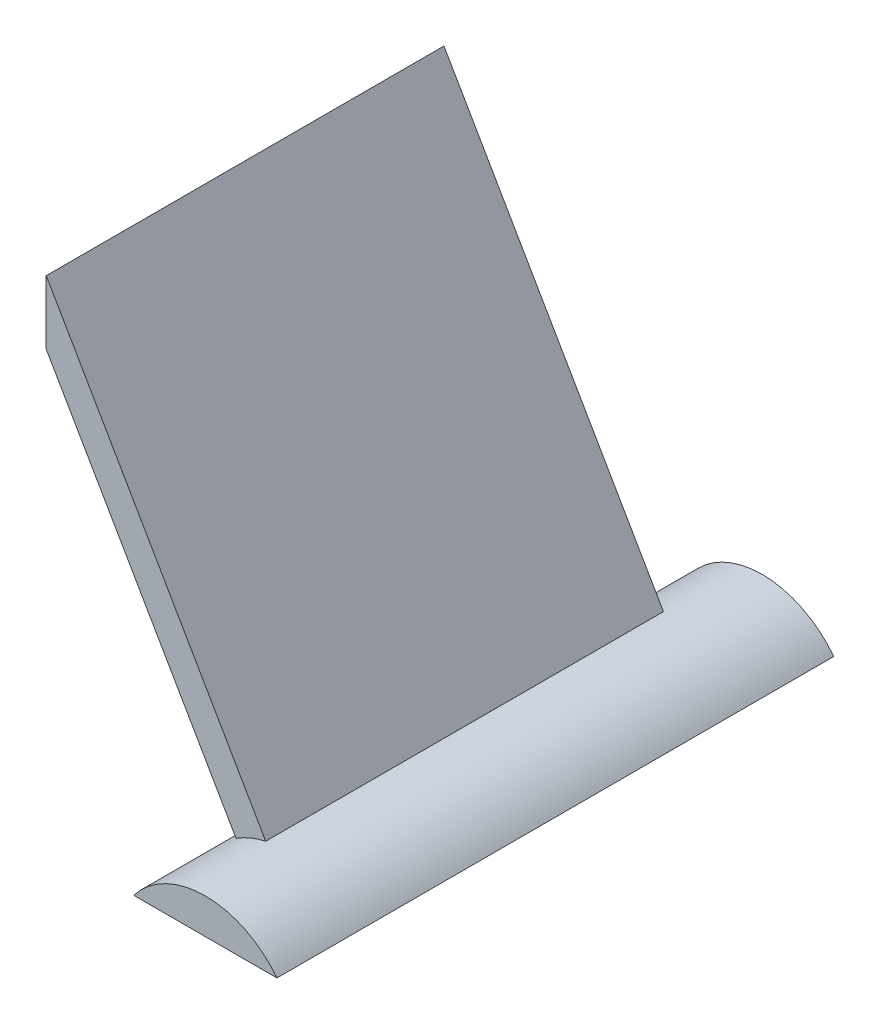
ISO-10303-21;
HEADER;
FILE_DESCRIPTION(('STEP AP214'),'2;1');
FILE_NAME('part.step','',(''),(''),'','','');
FILE_SCHEMA(('AUTOMOTIVE_DESIGN { 1 0 10303 214 1 1 1 1 }'));
ENDSEC;
DATA;
#1=APPLICATION_CONTEXT('core data for automotive mechanical design processes');
#2=APPLICATION_PROTOCOL_DEFINITION('international standard','automotive_design',2000,#1);
#3=PRODUCT_CONTEXT('',#1,'mechanical');
#4=PRODUCT('Part','Part','',(#3));
#5=PRODUCT_RELATED_PRODUCT_CATEGORY('part','',(#4));
#6=PRODUCT_DEFINITION_FORMATION('','',#4);
#7=PRODUCT_DEFINITION_CONTEXT('part definition',#1,'design');
#8=PRODUCT_DEFINITION('design','',#6,#7);
#9=PRODUCT_DEFINITION_SHAPE('','',#8);
#10=(LENGTH_UNIT() NAMED_UNIT(*) SI_UNIT(.MILLI.,.METRE.));
#11=(NAMED_UNIT(*) PLANE_ANGLE_UNIT() SI_UNIT($,.RADIAN.));
#12=(NAMED_UNIT(*) SI_UNIT($,.STERADIAN.) SOLID_ANGLE_UNIT());
#13=UNCERTAINTY_MEASURE_WITH_UNIT(LENGTH_MEASURE(1.E-05),#10,'distance_accuracy_value','');
#14=(GEOMETRIC_REPRESENTATION_CONTEXT(3) GLOBAL_UNCERTAINTY_ASSIGNED_CONTEXT((#13)) GLOBAL_UNIT_ASSIGNED_CONTEXT((#10,
#11,#12)) REPRESENTATION_CONTEXT('',''));
#15=CARTESIAN_POINT('',(0.,0.,0.));
#16=DIRECTION('',(0.,0.,1.));
#17=DIRECTION('',(1.,0.,0.));
#18=AXIS2_PLACEMENT_3D('',#15,#16,#17);
#19=CARTESIAN_POINT('',(90.17,0.,-88.9));
#20=DIRECTION('',(0.,-1.,0.));
#21=DIRECTION('',(0.,0.,-1.));
#22=AXIS2_PLACEMENT_3D('',#19,#20,#21);
#23=PLANE('',#22);
#24=DIRECTION('',(1.,0.,0.));
#25=VECTOR('',#24,1.);
#26=CARTESIAN_POINT('',(90.17,0.,0.));
#27=LINE('',#26,#25);
#28=CARTESIAN_POINT('',(67.31,0.,0.));
#29=VERTEX_POINT('',#28);
#30=CARTESIAN_POINT('',(90.17,0.,0.));
#31=VERTEX_POINT('',#30);
#32=EDGE_CURVE('E73',#29,#31,#27,.T.);
#33=ORIENTED_EDGE('',*,*,#32,.F.);
#34=DIRECTION('',(0.,0.,1.));
#35=VECTOR('',#34,1.);
#36=CARTESIAN_POINT('',(67.31,0.,-88.9));
#37=LINE('',#36,#35);
#38=CARTESIAN_POINT('',(67.31,0.,-88.9));
#39=VERTEX_POINT('',#38);
#40=EDGE_CURVE('E69',#39,#29,#37,.T.);
#41=ORIENTED_EDGE('',*,*,#40,.F.);
#42=DIRECTION('',(1.,0.,0.));
#43=VECTOR('',#42,1.);
#44=CARTESIAN_POINT('',(90.17,0.,-88.9));
#45=LINE('',#44,#43);
#46=CARTESIAN_POINT('',(90.17,0.,-88.9));
#47=VERTEX_POINT('',#46);
#48=EDGE_CURVE('E79',#39,#47,#45,.T.);
#49=ORIENTED_EDGE('',*,*,#48,.T.);
#50=DIRECTION('',(0.,0.,1.));
#51=VECTOR('',#50,1.);
#52=CARTESIAN_POINT('',(90.17,0.,-88.9));
#53=LINE('',#52,#51);
#54=EDGE_CURVE('E57',#47,#31,#53,.T.);
#55=ORIENTED_EDGE('',*,*,#54,.T.);
#56=EDGE_LOOP('',(#33,#41,#49,#55));
#57=FACE_BOUND('',#56,.T.);
#58=ADVANCED_FACE('F33',(#57),#23,.T.);
#59=CARTESIAN_POINT('',(78.74,-8.76505945945948,-88.9));
#60=DIRECTION('',(0.,0.,1.));
#61=DIRECTION('',(1.,0.,0.));
#62=AXIS2_PLACEMENT_3D('',#59,#60,#61);
#63=CYLINDRICAL_SURFACE('',#62,14.4038594594595);
#64=CARTESIAN_POINT('',(78.74,-8.76505945945948,-76.2));
#65=DIRECTION('',(0.,0.,-1.));
#66=DIRECTION('',(-1.,0.,0.));
#67=AXIS2_PLACEMENT_3D('',#64,#65,#66);
#68=CIRCLE('',#67,14.4038594594595);
#69=CARTESIAN_POINT('',(75.6749046811141,5.30890082235188,-76.2));
#70=VERTEX_POINT('',#69);
#71=CARTESIAN_POINT('',(70.942491559073,3.34568079213262,-76.2));
#72=VERTEX_POINT('',#71);
#73=EDGE_CURVE('E11',#70,#72,#68,.F.);
#74=ORIENTED_EDGE('',*,*,#73,.F.);
#75=DIRECTION('',(0.,0.,1.));
#76=VECTOR('',#75,1.);
#77=CARTESIAN_POINT('',(75.6749046811141,5.30890082235188,-76.2));
#78=LINE('',#77,#76);
#79=CARTESIAN_POINT('',(75.6749046811141,5.30890082235188,-12.7));
#80=VERTEX_POINT('',#79);
#81=EDGE_CURVE('E96',#70,#80,#78,.T.);
#82=ORIENTED_EDGE('',*,*,#81,.T.);
#83=CARTESIAN_POINT('',(78.74,-8.76505945945948,-12.7));
#84=DIRECTION('',(0.,0.,-1.));
#85=DIRECTION('',(-1.,0.,0.));
#86=AXIS2_PLACEMENT_3D('',#83,#84,#85);
#87=CIRCLE('',#86,14.4038594594595);
#88=CARTESIAN_POINT('',(70.9424915590731,3.34568079213265,-12.7));
#89=VERTEX_POINT('',#88);
#90=EDGE_CURVE('E41',#80,#89,#87,.F.);
#91=ORIENTED_EDGE('',*,*,#90,.T.);
#92=DIRECTION('',(0.,0.,1.));
#93=VECTOR('',#92,1.);
#94=CARTESIAN_POINT('',(70.942491559073,3.34568079213262,-76.2));
#95=LINE('',#94,#93);
#96=EDGE_CURVE('E93',#72,#89,#95,.T.);
#97=ORIENTED_EDGE('',*,*,#96,.F.);
#98=EDGE_LOOP('',(#74,#82,#91,#97));
#99=FACE_BOUND('',#98,.T.);
#100=CARTESIAN_POINT('',(78.74,-8.76505945945948,0.));
#101=DIRECTION('',(0.,0.,1.));
#102=DIRECTION('',(-1.,0.,0.));
#103=AXIS2_PLACEMENT_3D('',#100,#101,#102);
#104=CIRCLE('',#103,14.4038594594595);
#105=EDGE_CURVE('E67',#31,#29,#104,.T.);
#106=ORIENTED_EDGE('',*,*,#105,.F.);
#107=ORIENTED_EDGE('',*,*,#54,.F.);
#108=CARTESIAN_POINT('',(78.74,-8.76505945945948,-88.9));
#109=DIRECTION('',(0.,0.,1.));
#110=DIRECTION('',(1.,0.,0.));
#111=AXIS2_PLACEMENT_3D('',#108,#109,#110);
#112=CIRCLE('',#111,14.4038594594595);
#113=EDGE_CURVE('E82',#47,#39,#112,.T.);
#114=ORIENTED_EDGE('',*,*,#113,.T.);
#115=ORIENTED_EDGE('',*,*,#40,.T.);
#116=EDGE_LOOP('',(#106,#107,#114,#115));
#117=FACE_BOUND('',#116,.T.);
#118=ADVANCED_FACE('F35',(#99,#117),#63,.T.);
#119=CARTESIAN_POINT('',(78.74,-8.76505945945948,-88.9));
#120=DIRECTION('',(0.,0.,1.));
#121=DIRECTION('',(1.,0.,0.));
#122=AXIS2_PLACEMENT_3D('',#119,#120,#121);
#123=PLANE('',#122);
#124=ORIENTED_EDGE('',*,*,#113,.F.);
#125=ORIENTED_EDGE('',*,*,#48,.F.);
#126=EDGE_LOOP('',(#124,#125));
#127=FACE_BOUND('',#126,.T.);
#128=ADVANCED_FACE('F158',(#127),#123,.F.);
#129=CARTESIAN_POINT('',(78.74,-8.76505945945948,0.));
#130=DIRECTION('',(0.,0.,1.));
#131=DIRECTION('',(1.,0.,0.));
#132=AXIS2_PLACEMENT_3D('',#129,#130,#131);
#133=PLANE('',#132);
#134=ORIENTED_EDGE('',*,*,#32,.T.);
#135=ORIENTED_EDGE('',*,*,#105,.T.);
#136=EDGE_LOOP('',(#134,#135));
#137=FACE_BOUND('',#136,.T.);
#138=ADVANCED_FACE('F81',(#137),#133,.T.);
#139=CARTESIAN_POINT('',(40.64,65.991135768374,-76.2));
#140=DIRECTION('',(-1.,0.,0.));
#141=DIRECTION('',(0.,0.,1.));
#142=AXIS2_PLACEMENT_3D('',#139,#140,#141);
#143=PLANE('',#142);
#144=DIRECTION('',(0.,0.,1.));
#145=VECTOR('',#144,1.);
#146=CARTESIAN_POINT('',(40.64,55.831135768374,-76.2));
#147=LINE('',#146,#145);
#148=CARTESIAN_POINT('',(40.64,55.831135768374,-76.2));
#149=VERTEX_POINT('',#148);
#150=CARTESIAN_POINT('',(40.64,55.831135768374,-12.7));
#151=VERTEX_POINT('',#150);
#152=EDGE_CURVE('E125',#149,#151,#147,.T.);
#153=ORIENTED_EDGE('',*,*,#152,.T.);
#154=DIRECTION('',(0.,-1.,0.));
#155=VECTOR('',#154,1.);
#156=CARTESIAN_POINT('',(40.64,65.991135768374,-12.7));
#157=LINE('',#156,#155);
#158=CARTESIAN_POINT('',(40.64,65.991135768374,-12.7));
#159=VERTEX_POINT('',#158);
#160=EDGE_CURVE('E117',#159,#151,#157,.T.);
#161=ORIENTED_EDGE('',*,*,#160,.F.);
#162=DIRECTION('',(0.,0.,1.));
#163=VECTOR('',#162,1.);
#164=CARTESIAN_POINT('',(40.64,65.991135768374,-76.2));
#165=LINE('',#164,#163);
#166=CARTESIAN_POINT('',(40.64,65.991135768374,-76.2));
#167=VERTEX_POINT('',#166);
#168=EDGE_CURVE('E74',#167,#159,#165,.T.);
#169=ORIENTED_EDGE('',*,*,#168,.F.);
#170=DIRECTION('',(0.,-1.,0.));
#171=VECTOR('',#170,1.);
#172=CARTESIAN_POINT('',(40.64,65.991135768374,-76.2));
#173=LINE('',#172,#171);
#174=EDGE_CURVE('E112',#167,#149,#173,.T.);
#175=ORIENTED_EDGE('',*,*,#174,.T.);
#176=EDGE_LOOP('',(#153,#161,#169,#175));
#177=FACE_BOUND('',#176,.T.);
#178=ADVANCED_FACE('F132',(#177),#143,.T.);
#179=CARTESIAN_POINT('',(40.64,65.991135768374,-76.2));
#180=DIRECTION('',(0.866025403784438,0.500000000000001,0.));
#181=DIRECTION('',(-0.500000000000002,0.866025403784438,0.));
#182=AXIS2_PLACEMENT_3D('',#179,#180,#181);
#183=PLANE('',#182);
#184=ORIENTED_EDGE('',*,*,#168,.T.);
#185=DIRECTION('',(-0.500000000000001,0.866025403784438,0.));
#186=VECTOR('',#185,1.);
#187=CARTESIAN_POINT('',(40.64,65.991135768374,-12.7));
#188=LINE('',#187,#186);
#189=EDGE_CURVE('E101',#80,#159,#188,.T.);
#190=ORIENTED_EDGE('',*,*,#189,.F.);
#191=ORIENTED_EDGE('',*,*,#81,.F.);
#192=DIRECTION('',(-0.500000000000001,0.866025403784438,0.));
#193=VECTOR('',#192,1.);
#194=CARTESIAN_POINT('',(40.64,65.991135768374,-76.2));
#195=LINE('',#194,#193);
#196=EDGE_CURVE('E123',#70,#167,#195,.T.);
#197=ORIENTED_EDGE('',*,*,#196,.T.);
#198=EDGE_LOOP('',(#184,#190,#191,#197));
#199=FACE_BOUND('',#198,.T.);
#200=ADVANCED_FACE('F107',(#199),#183,.T.);
#201=CARTESIAN_POINT('',(40.64,55.831135768374,-76.2));
#202=DIRECTION('',(-0.866025403784438,-0.500000000000001,0.));
#203=DIRECTION('',(0.500000000000001,-0.866025403784438,0.));
#204=AXIS2_PLACEMENT_3D('',#201,#202,#203);
#205=PLANE('',#204);
#206=ORIENTED_EDGE('',*,*,#96,.T.);
#207=DIRECTION('',(0.500000000000001,-0.866025403784438,0.));
#208=VECTOR('',#207,1.);
#209=CARTESIAN_POINT('',(40.64,55.831135768374,-12.7));
#210=LINE('',#209,#208);
#211=EDGE_CURVE('E48',#151,#89,#210,.T.);
#212=ORIENTED_EDGE('',*,*,#211,.F.);
#213=ORIENTED_EDGE('',*,*,#152,.F.);
#214=DIRECTION('',(0.500000000000001,-0.866025403784438,0.));
#215=VECTOR('',#214,1.);
#216=CARTESIAN_POINT('',(40.64,55.831135768374,-76.2));
#217=LINE('',#216,#215);
#218=EDGE_CURVE('E115',#149,#72,#217,.T.);
#219=ORIENTED_EDGE('',*,*,#218,.T.);
#220=EDGE_LOOP('',(#206,#212,#213,#219));
#221=FACE_BOUND('',#220,.T.);
#222=ADVANCED_FACE('F138',(#221),#205,.T.);
#223=CARTESIAN_POINT('',(80.7959622615441,-13.7210310954385,-76.2));
#224=DIRECTION('',(0.,0.,-1.));
#225=DIRECTION('',(-1.,0.,0.));
#226=AXIS2_PLACEMENT_3D('',#223,#224,#225);
#227=PLANE('',#226);
#228=ORIENTED_EDGE('',*,*,#196,.F.);
#229=ORIENTED_EDGE('',*,*,#73,.T.);
#230=ORIENTED_EDGE('',*,*,#218,.F.);
#231=ORIENTED_EDGE('',*,*,#174,.F.);
#232=EDGE_LOOP('',(#228,#229,#230,#231));
#233=FACE_BOUND('',#232,.T.);
#234=ADVANCED_FACE('F141',(#233),#227,.T.);
#235=CARTESIAN_POINT('',(80.7959622615441,-13.7210310954385,-12.7));
#236=DIRECTION('',(0.,0.,-1.));
#237=DIRECTION('',(-1.,0.,0.));
#238=AXIS2_PLACEMENT_3D('',#235,#236,#237);
#239=PLANE('',#238);
#240=ORIENTED_EDGE('',*,*,#90,.F.);
#241=ORIENTED_EDGE('',*,*,#189,.T.);
#242=ORIENTED_EDGE('',*,*,#160,.T.);
#243=ORIENTED_EDGE('',*,*,#211,.T.);
#244=EDGE_LOOP('',(#240,#241,#242,#243));
#245=FACE_BOUND('',#244,.T.);
#246=ADVANCED_FACE('F99',(#245),#239,.F.);
#247=CLOSED_SHELL('',(#58,#118,#128,#138,#178,#200,#222,#234,#246));
#248=MANIFOLD_SOLID_BREP('B2',#247);
#249=ADVANCED_BREP_SHAPE_REPRESENTATION('',(#18,#248),#14);
#250=SHAPE_DEFINITION_REPRESENTATION(#9,#249);
ENDSEC;
END-ISO-10303-21;
